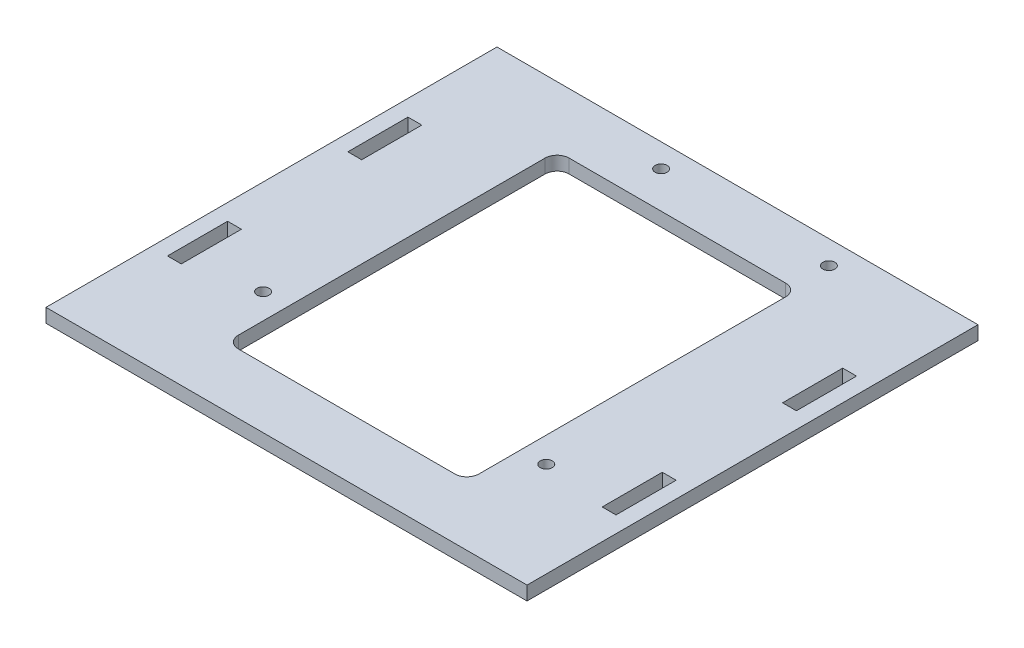
ISO-10303-21;
HEADER;
FILE_DESCRIPTION(('STEP AP214'),'2;1');
FILE_NAME('part.step','',(''),(''),'','','');
FILE_SCHEMA(('AUTOMOTIVE_DESIGN { 1 0 10303 214 1 1 1 1 }'));
ENDSEC;
DATA;
#1=APPLICATION_CONTEXT('core data for automotive mechanical design processes');
#2=APPLICATION_PROTOCOL_DEFINITION('international standard','automotive_design',2000,#1);
#3=PRODUCT_CONTEXT('',#1,'mechanical');
#4=PRODUCT('Part','Part','',(#3));
#5=PRODUCT_RELATED_PRODUCT_CATEGORY('part','',(#4));
#6=PRODUCT_DEFINITION_FORMATION('','',#4);
#7=PRODUCT_DEFINITION_CONTEXT('part definition',#1,'design');
#8=PRODUCT_DEFINITION('design','',#6,#7);
#9=PRODUCT_DEFINITION_SHAPE('','',#8);
#10=(LENGTH_UNIT() NAMED_UNIT(*) SI_UNIT(.MILLI.,.METRE.));
#11=(NAMED_UNIT(*) PLANE_ANGLE_UNIT() SI_UNIT($,.RADIAN.));
#12=(NAMED_UNIT(*) SI_UNIT($,.STERADIAN.) SOLID_ANGLE_UNIT());
#13=UNCERTAINTY_MEASURE_WITH_UNIT(LENGTH_MEASURE(1.E-05),#10,'distance_accuracy_value','');
#14=(GEOMETRIC_REPRESENTATION_CONTEXT(3) GLOBAL_UNCERTAINTY_ASSIGNED_CONTEXT((#13)) GLOBAL_UNIT_ASSIGNED_CONTEXT((#10,
#11,#12)) REPRESENTATION_CONTEXT('',''));
#15=CARTESIAN_POINT('',(0.,0.,0.));
#16=DIRECTION('',(0.,0.,1.));
#17=DIRECTION('',(1.,0.,0.));
#18=AXIS2_PLACEMENT_3D('',#15,#16,#17);
#19=CARTESIAN_POINT('',(0.,2.3,0.));
#20=DIRECTION('',(1.,0.,0.));
#21=DIRECTION('',(0.,0.,-1.));
#22=AXIS2_PLACEMENT_3D('',#19,#20,#21);
#23=PLANE('',#22);
#24=DIRECTION('',(0.,0.,1.));
#25=VECTOR('',#24,1.);
#26=CARTESIAN_POINT('',(0.,0.,0.));
#27=LINE('',#26,#25);
#28=CARTESIAN_POINT('',(0.,0.,-75.));
#29=VERTEX_POINT('',#28);
#30=CARTESIAN_POINT('',(0.,0.,0.));
#31=VERTEX_POINT('',#30);
#32=EDGE_CURVE('E359',#29,#31,#27,.T.);
#33=ORIENTED_EDGE('',*,*,#32,.T.);
#34=DIRECTION('',(0.,-1.,0.));
#35=VECTOR('',#34,1.);
#36=CARTESIAN_POINT('',(0.,2.3,0.));
#37=LINE('',#36,#35);
#38=CARTESIAN_POINT('',(0.,2.3,0.));
#39=VERTEX_POINT('',#38);
#40=EDGE_CURVE('E386',#39,#31,#37,.T.);
#41=ORIENTED_EDGE('',*,*,#40,.F.);
#42=DIRECTION('',(0.,0.,1.));
#43=VECTOR('',#42,1.);
#44=CARTESIAN_POINT('',(0.,2.3,0.));
#45=LINE('',#44,#43);
#46=CARTESIAN_POINT('',(0.,2.3,-75.));
#47=VERTEX_POINT('',#46);
#48=EDGE_CURVE('E360',#47,#39,#45,.T.);
#49=ORIENTED_EDGE('',*,*,#48,.F.);
#50=DIRECTION('',(0.,-1.,0.));
#51=VECTOR('',#50,1.);
#52=CARTESIAN_POINT('',(0.,2.3,-75.));
#53=LINE('',#52,#51);
#54=EDGE_CURVE('E370',#47,#29,#53,.T.);
#55=ORIENTED_EDGE('',*,*,#54,.T.);
#56=EDGE_LOOP('',(#33,#41,#49,#55));
#57=FACE_BOUND('',#56,.T.);
#58=ADVANCED_FACE('F33',(#57),#23,.F.);
#59=CARTESIAN_POINT('',(0.,2.3,0.));
#60=DIRECTION('',(0.,0.,-1.));
#61=DIRECTION('',(-1.,0.,0.));
#62=AXIS2_PLACEMENT_3D('',#59,#60,#61);
#63=PLANE('',#62);
#64=DIRECTION('',(1.,0.,0.));
#65=VECTOR('',#64,1.);
#66=CARTESIAN_POINT('',(0.,0.,0.));
#67=LINE('',#66,#65);
#68=CARTESIAN_POINT('',(80.,0.,0.));
#69=VERTEX_POINT('',#68);
#70=EDGE_CURVE('E373',#31,#69,#67,.T.);
#71=ORIENTED_EDGE('',*,*,#70,.T.);
#72=DIRECTION('',(0.,-1.,0.));
#73=VECTOR('',#72,1.);
#74=CARTESIAN_POINT('',(80.,2.3,0.));
#75=LINE('',#74,#73);
#76=CARTESIAN_POINT('',(80.,2.3,0.));
#77=VERTEX_POINT('',#76);
#78=EDGE_CURVE('E383',#77,#69,#75,.T.);
#79=ORIENTED_EDGE('',*,*,#78,.F.);
#80=DIRECTION('',(1.,0.,0.));
#81=VECTOR('',#80,1.);
#82=CARTESIAN_POINT('',(0.,2.3,0.));
#83=LINE('',#82,#81);
#84=EDGE_CURVE('E363',#39,#77,#83,.T.);
#85=ORIENTED_EDGE('',*,*,#84,.F.);
#86=ORIENTED_EDGE('',*,*,#40,.T.);
#87=EDGE_LOOP('',(#71,#79,#85,#86));
#88=FACE_BOUND('',#87,.T.);
#89=ADVANCED_FACE('F465',(#88),#63,.F.);
#90=CARTESIAN_POINT('',(80.,2.3,-75.));
#91=DIRECTION('',(-1.,0.,0.));
#92=DIRECTION('',(0.,0.,1.));
#93=AXIS2_PLACEMENT_3D('',#90,#91,#92);
#94=PLANE('',#93);
#95=DIRECTION('',(0.,0.,-1.));
#96=VECTOR('',#95,1.);
#97=CARTESIAN_POINT('',(80.,0.,-75.));
#98=LINE('',#97,#96);
#99=CARTESIAN_POINT('',(80.,0.,-75.));
#100=VERTEX_POINT('',#99);
#101=EDGE_CURVE('E375',#69,#100,#98,.T.);
#102=ORIENTED_EDGE('',*,*,#101,.T.);
#103=DIRECTION('',(0.,-1.,0.));
#104=VECTOR('',#103,1.);
#105=CARTESIAN_POINT('',(80.,2.3,-75.));
#106=LINE('',#105,#104);
#107=CARTESIAN_POINT('',(80.,2.3,-75.));
#108=VERTEX_POINT('',#107);
#109=EDGE_CURVE('E380',#108,#100,#106,.T.);
#110=ORIENTED_EDGE('',*,*,#109,.F.);
#111=DIRECTION('',(0.,0.,-1.));
#112=VECTOR('',#111,1.);
#113=CARTESIAN_POINT('',(80.,2.3,-75.));
#114=LINE('',#113,#112);
#115=EDGE_CURVE('E366',#77,#108,#114,.T.);
#116=ORIENTED_EDGE('',*,*,#115,.F.);
#117=ORIENTED_EDGE('',*,*,#78,.T.);
#118=EDGE_LOOP('',(#102,#110,#116,#117));
#119=FACE_BOUND('',#118,.T.);
#120=ADVANCED_FACE('F471',(#119),#94,.F.);
#121=CARTESIAN_POINT('',(0.,2.3,-75.));
#122=DIRECTION('',(0.,0.,1.));
#123=DIRECTION('',(1.,0.,0.));
#124=AXIS2_PLACEMENT_3D('',#121,#122,#123);
#125=PLANE('',#124);
#126=DIRECTION('',(-1.,0.,0.));
#127=VECTOR('',#126,1.);
#128=CARTESIAN_POINT('',(0.,0.,-75.));
#129=LINE('',#128,#127);
#130=EDGE_CURVE('E364',#100,#29,#129,.T.);
#131=ORIENTED_EDGE('',*,*,#130,.T.);
#132=ORIENTED_EDGE('',*,*,#54,.F.);
#133=DIRECTION('',(-1.,0.,0.));
#134=VECTOR('',#133,1.);
#135=CARTESIAN_POINT('',(0.,2.3,-75.));
#136=LINE('',#135,#134);
#137=EDGE_CURVE('E368',#108,#47,#136,.T.);
#138=ORIENTED_EDGE('',*,*,#137,.F.);
#139=ORIENTED_EDGE('',*,*,#109,.T.);
#140=EDGE_LOOP('',(#131,#132,#138,#139));
#141=FACE_BOUND('',#140,.T.);
#142=ADVANCED_FACE('F518',(#141),#125,.F.);
#143=CARTESIAN_POINT('',(0.,2.3,0.));
#144=DIRECTION('',(0.,-1.,0.));
#145=DIRECTION('',(0.,0.,-1.));
#146=AXIS2_PLACEMENT_3D('',#143,#144,#145);
#147=PLANE('',#146);
#148=DIRECTION('',(0.,0.,-1.));
#149=VECTOR('',#148,1.);
#150=CARTESIAN_POINT('',(60.,2.3,-10.));
#151=LINE('',#150,#149);
#152=CARTESIAN_POINT('',(60.,2.3,-12.));
#153=VERTEX_POINT('',#152);
#154=CARTESIAN_POINT('',(60.,2.3,-63.));
#155=VERTEX_POINT('',#154);
#156=EDGE_CURVE('E489',#153,#155,#151,.T.);
#157=ORIENTED_EDGE('',*,*,#156,.F.);
#158=CARTESIAN_POINT('',(58.,2.3,-12.));
#159=DIRECTION('',(0.,-1.,0.));
#160=DIRECTION('',(0.,0.,-1.));
#161=AXIS2_PLACEMENT_3D('',#158,#159,#160);
#162=CIRCLE('',#161,2.);
#163=CARTESIAN_POINT('',(58.,2.3,-10.));
#164=VERTEX_POINT('',#163);
#165=EDGE_CURVE('E433',#153,#164,#162,.T.);
#166=ORIENTED_EDGE('',*,*,#165,.T.);
#167=DIRECTION('',(1.,0.,0.));
#168=VECTOR('',#167,1.);
#169=CARTESIAN_POINT('',(40.,2.3,-10.));
#170=LINE('',#169,#168);
#171=CARTESIAN_POINT('',(22.,2.3,-10.));
#172=VERTEX_POINT('',#171);
#173=EDGE_CURVE('E497',#172,#164,#170,.T.);
#174=ORIENTED_EDGE('',*,*,#173,.F.);
#175=CARTESIAN_POINT('',(22.,2.3,-12.));
#176=DIRECTION('',(0.,-1.,0.));
#177=DIRECTION('',(0.,0.,-1.));
#178=AXIS2_PLACEMENT_3D('',#175,#176,#177);
#179=CIRCLE('',#178,2.);
#180=CARTESIAN_POINT('',(20.,2.3,-12.));
#181=VERTEX_POINT('',#180);
#182=EDGE_CURVE('E437',#172,#181,#179,.T.);
#183=ORIENTED_EDGE('',*,*,#182,.T.);
#184=DIRECTION('',(0.,0.,1.));
#185=VECTOR('',#184,1.);
#186=CARTESIAN_POINT('',(20.,2.3,-65.));
#187=LINE('',#186,#185);
#188=CARTESIAN_POINT('',(20.,2.3,-63.));
#189=VERTEX_POINT('',#188);
#190=EDGE_CURVE('E492',#189,#181,#187,.T.);
#191=ORIENTED_EDGE('',*,*,#190,.F.);
#192=CARTESIAN_POINT('',(22.,2.3,-63.));
#193=DIRECTION('',(0.,-1.,0.));
#194=DIRECTION('',(0.,0.,-1.));
#195=AXIS2_PLACEMENT_3D('',#192,#193,#194);
#196=CIRCLE('',#195,2.);
#197=CARTESIAN_POINT('',(22.,2.3,-65.));
#198=VERTEX_POINT('',#197);
#199=EDGE_CURVE('E41',#189,#198,#196,.T.);
#200=ORIENTED_EDGE('',*,*,#199,.T.);
#201=DIRECTION('',(-1.,0.,0.));
#202=VECTOR('',#201,1.);
#203=CARTESIAN_POINT('',(60.,2.3,-65.));
#204=LINE('',#203,#202);
#205=CARTESIAN_POINT('',(58.,2.3,-65.));
#206=VERTEX_POINT('',#205);
#207=EDGE_CURVE('E490',#206,#198,#204,.T.);
#208=ORIENTED_EDGE('',*,*,#207,.F.);
#209=CARTESIAN_POINT('',(58.,2.3,-63.));
#210=DIRECTION('',(0.,-1.,0.));
#211=DIRECTION('',(0.,0.,-1.));
#212=AXIS2_PLACEMENT_3D('',#209,#210,#211);
#213=CIRCLE('',#212,2.);
#214=EDGE_CURVE('E55',#206,#155,#213,.T.);
#215=ORIENTED_EDGE('',*,*,#214,.T.);
#216=EDGE_LOOP('',(#157,#166,#174,#183,#191,#200,#208,#215));
#217=FACE_BOUND('',#216,.T.);
#218=CARTESIAN_POINT('',(59.1,2.3,-71.1));
#219=DIRECTION('',(0.,1.,0.));
#220=DIRECTION('',(0.,0.,1.));
#221=AXIS2_PLACEMENT_3D('',#218,#219,#220);
#222=CIRCLE('',#221,0.999999999999998);
#223=CARTESIAN_POINT('',(59.1,2.3,-70.1));
#224=VERTEX_POINT('',#223);
#225=EDGE_CURVE('E397',#224,#224,#222,.T.);
#226=ORIENTED_EDGE('',*,*,#225,.F.);
#227=EDGE_LOOP('',(#226));
#228=FACE_BOUND('',#227,.T.);
#229=CARTESIAN_POINT('',(15.8,2.3,-20.3));
#230=DIRECTION('',(0.,1.,0.));
#231=DIRECTION('',(0.,0.,1.));
#232=AXIS2_PLACEMENT_3D('',#229,#230,#231);
#233=CIRCLE('',#232,1.);
#234=CARTESIAN_POINT('',(15.8,2.3,-19.3));
#235=VERTEX_POINT('',#234);
#236=EDGE_CURVE('E503',#235,#235,#233,.T.);
#237=ORIENTED_EDGE('',*,*,#236,.F.);
#238=EDGE_LOOP('',(#237));
#239=FACE_BOUND('',#238,.T.);
#240=CARTESIAN_POINT('',(64.2,2.3,-19.));
#241=DIRECTION('',(0.,1.,0.));
#242=DIRECTION('',(0.,0.,1.));
#243=AXIS2_PLACEMENT_3D('',#240,#241,#242);
#244=CIRCLE('',#243,0.999999999999998);
#245=CARTESIAN_POINT('',(64.2,2.3,-18.));
#246=VERTEX_POINT('',#245);
#247=EDGE_CURVE('E500',#246,#246,#244,.T.);
#248=ORIENTED_EDGE('',*,*,#247,.F.);
#249=EDGE_LOOP('',(#248));
#250=FACE_BOUND('',#249,.T.);
#251=CARTESIAN_POINT('',(31.2,2.3,-71.1));
#252=DIRECTION('',(0.,1.,0.));
#253=DIRECTION('',(0.,0.,1.));
#254=AXIS2_PLACEMENT_3D('',#251,#252,#253);
#255=CIRCLE('',#254,0.999999999999995);
#256=CARTESIAN_POINT('',(31.2,2.3,-70.1));
#257=VERTEX_POINT('',#256);
#258=EDGE_CURVE('E392',#257,#257,#255,.T.);
#259=ORIENTED_EDGE('',*,*,#258,.F.);
#260=EDGE_LOOP('',(#259));
#261=FACE_BOUND('',#260,.T.);
#262=DIRECTION('',(0.,0.,-1.));
#263=VECTOR('',#262,1.);
#264=CARTESIAN_POINT('',(2.69999999999999,2.3,0.));
#265=LINE('',#264,#263);
#266=CARTESIAN_POINT('',(2.69999999999999,2.3,-17.5));
#267=VERTEX_POINT('',#266);
#268=CARTESIAN_POINT('',(2.69999999999999,2.3,-27.5));
#269=VERTEX_POINT('',#268);
#270=EDGE_CURVE('E321',#267,#269,#265,.T.);
#271=ORIENTED_EDGE('',*,*,#270,.T.);
#272=DIRECTION('',(1.,0.,0.));
#273=VECTOR('',#272,1.);
#274=CARTESIAN_POINT('',(0.,2.3,-27.5));
#275=LINE('',#274,#273);
#276=CARTESIAN_POINT('',(4.99999999999999,2.3,-27.5));
#277=VERTEX_POINT('',#276);
#278=EDGE_CURVE('E324',#269,#277,#275,.T.);
#279=ORIENTED_EDGE('',*,*,#278,.T.);
#280=DIRECTION('',(0.,0.,1.));
#281=VECTOR('',#280,1.);
#282=CARTESIAN_POINT('',(4.99999999999999,2.3,0.));
#283=LINE('',#282,#281);
#284=CARTESIAN_POINT('',(4.99999999999999,2.3,-17.5));
#285=VERTEX_POINT('',#284);
#286=EDGE_CURVE('E315',#277,#285,#283,.T.);
#287=ORIENTED_EDGE('',*,*,#286,.T.);
#288=DIRECTION('',(-1.,0.,0.));
#289=VECTOR('',#288,1.);
#290=CARTESIAN_POINT('',(0.,2.3,-17.5));
#291=LINE('',#290,#289);
#292=EDGE_CURVE('E318',#285,#267,#291,.T.);
#293=ORIENTED_EDGE('',*,*,#292,.T.);
#294=EDGE_LOOP('',(#271,#279,#287,#293));
#295=FACE_BOUND('',#294,.T.);
#296=DIRECTION('',(0.,0.,-1.));
#297=VECTOR('',#296,1.);
#298=CARTESIAN_POINT('',(75.,2.3,0.));
#299=LINE('',#298,#297);
#300=CARTESIAN_POINT('',(75.,2.3,-47.5));
#301=VERTEX_POINT('',#300);
#302=CARTESIAN_POINT('',(75.,2.3,-57.5));
#303=VERTEX_POINT('',#302);
#304=EDGE_CURVE('E309',#301,#303,#299,.T.);
#305=ORIENTED_EDGE('',*,*,#304,.T.);
#306=DIRECTION('',(1.,0.,0.));
#307=VECTOR('',#306,1.);
#308=CARTESIAN_POINT('',(0.,2.3,-57.5));
#309=LINE('',#308,#307);
#310=CARTESIAN_POINT('',(77.3,2.3,-57.5));
#311=VERTEX_POINT('',#310);
#312=EDGE_CURVE('E312',#303,#311,#309,.T.);
#313=ORIENTED_EDGE('',*,*,#312,.T.);
#314=DIRECTION('',(0.,0.,1.));
#315=VECTOR('',#314,1.);
#316=CARTESIAN_POINT('',(77.3000000000001,2.3,-1.07275299754406E-13));
#317=LINE('',#316,#315);
#318=CARTESIAN_POINT('',(77.3,2.3,-47.5));
#319=VERTEX_POINT('',#318);
#320=EDGE_CURVE('E306',#311,#319,#317,.T.);
#321=ORIENTED_EDGE('',*,*,#320,.T.);
#322=DIRECTION('',(-1.,0.,0.));
#323=VECTOR('',#322,1.);
#324=CARTESIAN_POINT('',(0.,2.3,-47.5));
#325=LINE('',#324,#323);
#326=EDGE_CURVE('E226',#319,#301,#325,.T.);
#327=ORIENTED_EDGE('',*,*,#326,.T.);
#328=EDGE_LOOP('',(#305,#313,#321,#327));
#329=FACE_BOUND('',#328,.T.);
#330=DIRECTION('',(0.,0.,-1.));
#331=VECTOR('',#330,1.);
#332=CARTESIAN_POINT('',(2.69999999999999,2.3,0.));
#333=LINE('',#332,#331);
#334=CARTESIAN_POINT('',(2.69999999999999,2.3,-47.5));
#335=VERTEX_POINT('',#334);
#336=CARTESIAN_POINT('',(2.69999999999999,2.3,-57.5));
#337=VERTEX_POINT('',#336);
#338=EDGE_CURVE('E300',#335,#337,#333,.T.);
#339=ORIENTED_EDGE('',*,*,#338,.T.);
#340=DIRECTION('',(1.,0.,0.));
#341=VECTOR('',#340,1.);
#342=CARTESIAN_POINT('',(0.,2.3,-57.5));
#343=LINE('',#342,#341);
#344=CARTESIAN_POINT('',(4.99999999999999,2.3,-57.5));
#345=VERTEX_POINT('',#344);
#346=EDGE_CURVE('E303',#337,#345,#343,.T.);
#347=ORIENTED_EDGE('',*,*,#346,.T.);
#348=DIRECTION('',(0.,0.,1.));
#349=VECTOR('',#348,1.);
#350=CARTESIAN_POINT('',(4.99999999999999,2.3,0.));
#351=LINE('',#350,#349);
#352=CARTESIAN_POINT('',(4.99999999999999,2.3,-47.5));
#353=VERTEX_POINT('',#352);
#354=EDGE_CURVE('E288',#345,#353,#351,.T.);
#355=ORIENTED_EDGE('',*,*,#354,.T.);
#356=DIRECTION('',(-1.,0.,0.));
#357=VECTOR('',#356,1.);
#358=CARTESIAN_POINT('',(0.,2.3,-47.5));
#359=LINE('',#358,#357);
#360=EDGE_CURVE('E297',#353,#335,#359,.T.);
#361=ORIENTED_EDGE('',*,*,#360,.T.);
#362=EDGE_LOOP('',(#339,#347,#355,#361));
#363=FACE_BOUND('',#362,.T.);
#364=DIRECTION('',(0.,0.,-1.));
#365=VECTOR('',#364,1.);
#366=CARTESIAN_POINT('',(75.,2.3,0.));
#367=LINE('',#366,#365);
#368=CARTESIAN_POINT('',(75.,2.3,-17.5));
#369=VERTEX_POINT('',#368);
#370=CARTESIAN_POINT('',(75.,2.3,-27.5));
#371=VERTEX_POINT('',#370);
#372=EDGE_CURVE('E353',#369,#371,#367,.T.);
#373=ORIENTED_EDGE('',*,*,#372,.T.);
#374=DIRECTION('',(1.,0.,0.));
#375=VECTOR('',#374,1.);
#376=CARTESIAN_POINT('',(0.,2.3,-27.5000000000001));
#377=LINE('',#376,#375);
#378=CARTESIAN_POINT('',(77.3,2.3,-27.5));
#379=VERTEX_POINT('',#378);
#380=EDGE_CURVE('E356',#371,#379,#377,.T.);
#381=ORIENTED_EDGE('',*,*,#380,.T.);
#382=DIRECTION('',(0.,0.,1.));
#383=VECTOR('',#382,1.);
#384=CARTESIAN_POINT('',(77.3,2.3,0.));
#385=LINE('',#384,#383);
#386=CARTESIAN_POINT('',(77.3,2.3,-17.5));
#387=VERTEX_POINT('',#386);
#388=EDGE_CURVE('E341',#379,#387,#385,.T.);
#389=ORIENTED_EDGE('',*,*,#388,.T.);
#390=DIRECTION('',(-1.,0.,0.));
#391=VECTOR('',#390,1.);
#392=CARTESIAN_POINT('',(0.,2.3,-17.5));
#393=LINE('',#392,#391);
#394=EDGE_CURVE('E350',#387,#369,#393,.T.);
#395=ORIENTED_EDGE('',*,*,#394,.T.);
#396=EDGE_LOOP('',(#373,#381,#389,#395));
#397=FACE_BOUND('',#396,.T.);
#398=ORIENTED_EDGE('',*,*,#48,.T.);
#399=ORIENTED_EDGE('',*,*,#84,.T.);
#400=ORIENTED_EDGE('',*,*,#115,.T.);
#401=ORIENTED_EDGE('',*,*,#137,.T.);
#402=EDGE_LOOP('',(#398,#399,#400,#401));
#403=FACE_BOUND('',#402,.T.);
#404=ADVANCED_FACE('F515',(#217,#228,#239,#250,#261,#295,#329,#363,#397,#403),#147,.F.);
#405=CARTESIAN_POINT('',(0.,0.,0.));
#406=DIRECTION('',(0.,-1.,0.));
#407=DIRECTION('',(0.,0.,-1.));
#408=AXIS2_PLACEMENT_3D('',#405,#406,#407);
#409=PLANE('',#408);
#410=DIRECTION('',(-1.,0.,0.));
#411=VECTOR('',#410,1.);
#412=CARTESIAN_POINT('',(0.,0.,-9.99999999999999));
#413=LINE('',#412,#411);
#414=CARTESIAN_POINT('',(58.,0.,-10.));
#415=VERTEX_POINT('',#414);
#416=CARTESIAN_POINT('',(22.,0.,-10.));
#417=VERTEX_POINT('',#416);
#418=EDGE_CURVE('E411',#415,#417,#413,.T.);
#419=ORIENTED_EDGE('',*,*,#418,.F.);
#420=CARTESIAN_POINT('',(58.,0.,-12.));
#421=DIRECTION('',(0.,-1.,0.));
#422=DIRECTION('',(0.,0.,-1.));
#423=AXIS2_PLACEMENT_3D('',#420,#421,#422);
#424=CIRCLE('',#423,2.);
#425=CARTESIAN_POINT('',(60.,0.,-12.));
#426=VERTEX_POINT('',#425);
#427=EDGE_CURVE('E435',#415,#426,#424,.F.);
#428=ORIENTED_EDGE('',*,*,#427,.T.);
#429=DIRECTION('',(0.,0.,1.));
#430=VECTOR('',#429,1.);
#431=CARTESIAN_POINT('',(60.,0.,0.));
#432=LINE('',#431,#430);
#433=CARTESIAN_POINT('',(60.,0.,-63.));
#434=VERTEX_POINT('',#433);
#435=EDGE_CURVE('E389',#434,#426,#432,.T.);
#436=ORIENTED_EDGE('',*,*,#435,.F.);
#437=CARTESIAN_POINT('',(58.,0.,-63.));
#438=DIRECTION('',(0.,-1.,0.));
#439=DIRECTION('',(0.,0.,-1.));
#440=AXIS2_PLACEMENT_3D('',#437,#438,#439);
#441=CIRCLE('',#440,2.);
#442=CARTESIAN_POINT('',(58.,0.,-65.));
#443=VERTEX_POINT('',#442);
#444=EDGE_CURVE('E442',#434,#443,#441,.F.);
#445=ORIENTED_EDGE('',*,*,#444,.T.);
#446=DIRECTION('',(1.,0.,0.));
#447=VECTOR('',#446,1.);
#448=CARTESIAN_POINT('',(0.,0.,-65.));
#449=LINE('',#448,#447);
#450=CARTESIAN_POINT('',(22.,0.,-65.));
#451=VERTEX_POINT('',#450);
#452=EDGE_CURVE('E405',#451,#443,#449,.T.);
#453=ORIENTED_EDGE('',*,*,#452,.F.);
#454=CARTESIAN_POINT('',(22.,0.,-63.));
#455=DIRECTION('',(0.,-1.,0.));
#456=DIRECTION('',(0.,0.,-1.));
#457=AXIS2_PLACEMENT_3D('',#454,#455,#456);
#458=CIRCLE('',#457,2.);
#459=CARTESIAN_POINT('',(20.,0.,-63.));
#460=VERTEX_POINT('',#459);
#461=EDGE_CURVE('E11',#451,#460,#458,.F.);
#462=ORIENTED_EDGE('',*,*,#461,.T.);
#463=DIRECTION('',(0.,0.,-1.));
#464=VECTOR('',#463,1.);
#465=CARTESIAN_POINT('',(20.,0.,0.));
#466=LINE('',#465,#464);
#467=CARTESIAN_POINT('',(20.,0.,-12.));
#468=VERTEX_POINT('',#467);
#469=EDGE_CURVE('E408',#468,#460,#466,.T.);
#470=ORIENTED_EDGE('',*,*,#469,.F.);
#471=CARTESIAN_POINT('',(22.,0.,-12.));
#472=DIRECTION('',(0.,-1.,0.));
#473=DIRECTION('',(0.,0.,-1.));
#474=AXIS2_PLACEMENT_3D('',#471,#472,#473);
#475=CIRCLE('',#474,2.);
#476=EDGE_CURVE('E439',#468,#417,#475,.F.);
#477=ORIENTED_EDGE('',*,*,#476,.T.);
#478=EDGE_LOOP('',(#419,#428,#436,#445,#453,#462,#470,#477));
#479=FACE_BOUND('',#478,.T.);
#480=CARTESIAN_POINT('',(59.1,0.,-71.1));
#481=DIRECTION('',(0.,-1.,0.));
#482=DIRECTION('',(0.,0.,-1.));
#483=AXIS2_PLACEMENT_3D('',#480,#481,#482);
#484=CIRCLE('',#483,0.999999999999998);
#485=CARTESIAN_POINT('',(59.1,0.,-72.1));
#486=VERTEX_POINT('',#485);
#487=EDGE_CURVE('E400',#486,#486,#484,.T.);
#488=ORIENTED_EDGE('',*,*,#487,.F.);
#489=EDGE_LOOP('',(#488));
#490=FACE_BOUND('',#489,.T.);
#491=CARTESIAN_POINT('',(15.8,0.,-20.3));
#492=DIRECTION('',(0.,-1.,0.));
#493=DIRECTION('',(0.,0.,-1.));
#494=AXIS2_PLACEMENT_3D('',#491,#492,#493);
#495=CIRCLE('',#494,1.);
#496=CARTESIAN_POINT('',(15.8,0.,-21.3));
#497=VERTEX_POINT('',#496);
#498=EDGE_CURVE('E396',#497,#497,#495,.T.);
#499=ORIENTED_EDGE('',*,*,#498,.F.);
#500=EDGE_LOOP('',(#499));
#501=FACE_BOUND('',#500,.T.);
#502=CARTESIAN_POINT('',(64.2,0.,-19.));
#503=DIRECTION('',(0.,-1.,0.));
#504=DIRECTION('',(0.,0.,-1.));
#505=AXIS2_PLACEMENT_3D('',#502,#503,#504);
#506=CIRCLE('',#505,0.999999999999998);
#507=CARTESIAN_POINT('',(64.2,0.,-20.));
#508=VERTEX_POINT('',#507);
#509=EDGE_CURVE('E393',#508,#508,#506,.T.);
#510=ORIENTED_EDGE('',*,*,#509,.F.);
#511=EDGE_LOOP('',(#510));
#512=FACE_BOUND('',#511,.T.);
#513=CARTESIAN_POINT('',(31.2,0.,-71.1));
#514=DIRECTION('',(0.,-1.,0.));
#515=DIRECTION('',(0.,0.,-1.));
#516=AXIS2_PLACEMENT_3D('',#513,#514,#515);
#517=CIRCLE('',#516,0.999999999999995);
#518=CARTESIAN_POINT('',(31.2,0.,-72.1));
#519=VERTEX_POINT('',#518);
#520=EDGE_CURVE('E257',#519,#519,#517,.T.);
#521=ORIENTED_EDGE('',*,*,#520,.F.);
#522=EDGE_LOOP('',(#521));
#523=FACE_BOUND('',#522,.T.);
#524=DIRECTION('',(1.,0.,0.));
#525=VECTOR('',#524,1.);
#526=CARTESIAN_POINT('',(4.99999999999999,0.,-27.5));
#527=LINE('',#526,#525);
#528=CARTESIAN_POINT('',(2.69999999999999,0.,-27.5));
#529=VERTEX_POINT('',#528);
#530=CARTESIAN_POINT('',(4.99999999999999,0.,-27.5));
#531=VERTEX_POINT('',#530);
#532=EDGE_CURVE('E254',#529,#531,#527,.T.);
#533=ORIENTED_EDGE('',*,*,#532,.F.);
#534=DIRECTION('',(0.,0.,-1.));
#535=VECTOR('',#534,1.);
#536=CARTESIAN_POINT('',(2.69999999999999,0.,-27.5));
#537=LINE('',#536,#535);
#538=CARTESIAN_POINT('',(2.69999999999999,0.,-17.5));
#539=VERTEX_POINT('',#538);
#540=EDGE_CURVE('E263',#539,#529,#537,.T.);
#541=ORIENTED_EDGE('',*,*,#540,.F.);
#542=DIRECTION('',(-1.,0.,0.));
#543=VECTOR('',#542,1.);
#544=CARTESIAN_POINT('',(2.69999999999999,0.,-17.5));
#545=LINE('',#544,#543);
#546=CARTESIAN_POINT('',(4.99999999999999,0.,-17.5));
#547=VERTEX_POINT('',#546);
#548=EDGE_CURVE('E260',#547,#539,#545,.T.);
#549=ORIENTED_EDGE('',*,*,#548,.F.);
#550=DIRECTION('',(0.,0.,1.));
#551=VECTOR('',#550,1.);
#552=CARTESIAN_POINT('',(4.99999999999999,0.,-17.5));
#553=LINE('',#552,#551);
#554=EDGE_CURVE('E256',#531,#547,#553,.T.);
#555=ORIENTED_EDGE('',*,*,#554,.F.);
#556=EDGE_LOOP('',(#533,#541,#549,#555));
#557=FACE_BOUND('',#556,.T.);
#558=DIRECTION('',(1.,0.,0.));
#559=VECTOR('',#558,1.);
#560=CARTESIAN_POINT('',(77.3,0.,-57.5));
#561=LINE('',#560,#559);
#562=CARTESIAN_POINT('',(75.,0.,-57.5));
#563=VERTEX_POINT('',#562);
#564=CARTESIAN_POINT('',(77.3,0.,-57.5));
#565=VERTEX_POINT('',#564);
#566=EDGE_CURVE('E239',#563,#565,#561,.T.);
#567=ORIENTED_EDGE('',*,*,#566,.F.);
#568=DIRECTION('',(0.,0.,-1.));
#569=VECTOR('',#568,1.);
#570=CARTESIAN_POINT('',(75.,0.,-57.5));
#571=LINE('',#570,#569);
#572=CARTESIAN_POINT('',(75.,0.,-47.5));
#573=VERTEX_POINT('',#572);
#574=EDGE_CURVE('E244',#573,#563,#571,.T.);
#575=ORIENTED_EDGE('',*,*,#574,.F.);
#576=DIRECTION('',(-1.,0.,0.));
#577=VECTOR('',#576,1.);
#578=CARTESIAN_POINT('',(75.,0.,-47.5));
#579=LINE('',#578,#577);
#580=CARTESIAN_POINT('',(77.3,0.,-47.5));
#581=VERTEX_POINT('',#580);
#582=EDGE_CURVE('E223',#581,#573,#579,.T.);
#583=ORIENTED_EDGE('',*,*,#582,.F.);
#584=DIRECTION('',(0.,0.,1.));
#585=VECTOR('',#584,1.);
#586=CARTESIAN_POINT('',(77.3,0.,-57.5));
#587=LINE('',#586,#585);
#588=EDGE_CURVE('E234',#565,#581,#587,.T.);
#589=ORIENTED_EDGE('',*,*,#588,.F.);
#590=EDGE_LOOP('',(#567,#575,#583,#589));
#591=FACE_BOUND('',#590,.T.);
#592=DIRECTION('',(1.,0.,0.));
#593=VECTOR('',#592,1.);
#594=CARTESIAN_POINT('',(4.99999999999999,0.,-57.5));
#595=LINE('',#594,#593);
#596=CARTESIAN_POINT('',(2.69999999999999,0.,-57.5));
#597=VERTEX_POINT('',#596);
#598=CARTESIAN_POINT('',(4.99999999999999,0.,-57.5));
#599=VERTEX_POINT('',#598);
#600=EDGE_CURVE('E251',#597,#599,#595,.T.);
#601=ORIENTED_EDGE('',*,*,#600,.F.);
#602=DIRECTION('',(0.,0.,-1.));
#603=VECTOR('',#602,1.);
#604=CARTESIAN_POINT('',(2.69999999999999,0.,-57.5));
#605=LINE('',#604,#603);
#606=CARTESIAN_POINT('',(2.69999999999999,0.,-47.5));
#607=VERTEX_POINT('',#606);
#608=EDGE_CURVE('E282',#607,#597,#605,.T.);
#609=ORIENTED_EDGE('',*,*,#608,.F.);
#610=DIRECTION('',(-1.,0.,0.));
#611=VECTOR('',#610,1.);
#612=CARTESIAN_POINT('',(2.69999999999999,0.,-47.5));
#613=LINE('',#612,#611);
#614=CARTESIAN_POINT('',(4.99999999999999,0.,-47.5));
#615=VERTEX_POINT('',#614);
#616=EDGE_CURVE('E279',#615,#607,#613,.T.);
#617=ORIENTED_EDGE('',*,*,#616,.F.);
#618=DIRECTION('',(0.,0.,1.));
#619=VECTOR('',#618,1.);
#620=CARTESIAN_POINT('',(4.99999999999999,0.,-47.5));
#621=LINE('',#620,#619);
#622=EDGE_CURVE('E276',#599,#615,#621,.T.);
#623=ORIENTED_EDGE('',*,*,#622,.F.);
#624=EDGE_LOOP('',(#601,#609,#617,#623));
#625=FACE_BOUND('',#624,.T.);
#626=DIRECTION('',(1.,0.,0.));
#627=VECTOR('',#626,1.);
#628=CARTESIAN_POINT('',(75.,0.,-27.5));
#629=LINE('',#628,#627);
#630=CARTESIAN_POINT('',(75.,0.,-27.5));
#631=VERTEX_POINT('',#630);
#632=CARTESIAN_POINT('',(77.3,0.,-27.5));
#633=VERTEX_POINT('',#632);
#634=EDGE_CURVE('E327',#631,#633,#629,.T.);
#635=ORIENTED_EDGE('',*,*,#634,.F.);
#636=DIRECTION('',(0.,0.,-1.));
#637=VECTOR('',#636,1.);
#638=CARTESIAN_POINT('',(75.,0.,-17.5));
#639=LINE('',#638,#637);
#640=CARTESIAN_POINT('',(75.,0.,-17.5));
#641=VERTEX_POINT('',#640);
#642=EDGE_CURVE('E335',#641,#631,#639,.T.);
#643=ORIENTED_EDGE('',*,*,#642,.F.);
#644=DIRECTION('',(-1.,0.,0.));
#645=VECTOR('',#644,1.);
#646=CARTESIAN_POINT('',(77.3,0.,-17.5));
#647=LINE('',#646,#645);
#648=CARTESIAN_POINT('',(77.3,0.,-17.5));
#649=VERTEX_POINT('',#648);
#650=EDGE_CURVE('E332',#649,#641,#647,.T.);
#651=ORIENTED_EDGE('',*,*,#650,.F.);
#652=DIRECTION('',(0.,0.,1.));
#653=VECTOR('',#652,1.);
#654=CARTESIAN_POINT('',(77.3,0.,-27.5));
#655=LINE('',#654,#653);
#656=EDGE_CURVE('E329',#633,#649,#655,.T.);
#657=ORIENTED_EDGE('',*,*,#656,.F.);
#658=EDGE_LOOP('',(#635,#643,#651,#657));
#659=FACE_BOUND('',#658,.T.);
#660=ORIENTED_EDGE('',*,*,#32,.F.);
#661=ORIENTED_EDGE('',*,*,#130,.F.);
#662=ORIENTED_EDGE('',*,*,#101,.F.);
#663=ORIENTED_EDGE('',*,*,#70,.F.);
#664=EDGE_LOOP('',(#660,#661,#662,#663));
#665=FACE_BOUND('',#664,.T.);
#666=ADVANCED_FACE('F241',(#479,#490,#501,#512,#523,#557,#591,#625,#659,#665),#409,.T.);
#667=CARTESIAN_POINT('',(75.,10.,-27.5));
#668=DIRECTION('',(0.,0.,-1.));
#669=DIRECTION('',(-1.,0.,0.));
#670=AXIS2_PLACEMENT_3D('',#667,#668,#669);
#671=PLANE('',#670);
#672=DIRECTION('',(0.,-1.,0.));
#673=VECTOR('',#672,1.);
#674=CARTESIAN_POINT('',(75.,10.,-27.5));
#675=LINE('',#674,#673);
#676=EDGE_CURVE('E339',#371,#631,#675,.T.);
#677=ORIENTED_EDGE('',*,*,#676,.T.);
#678=ORIENTED_EDGE('',*,*,#634,.T.);
#679=DIRECTION('',(0.,-1.,0.));
#680=VECTOR('',#679,1.);
#681=CARTESIAN_POINT('',(77.3,10.,-27.5));
#682=LINE('',#681,#680);
#683=EDGE_CURVE('E338',#379,#633,#682,.T.);
#684=ORIENTED_EDGE('',*,*,#683,.F.);
#685=ORIENTED_EDGE('',*,*,#380,.F.);
#686=EDGE_LOOP('',(#677,#678,#684,#685));
#687=FACE_BOUND('',#686,.T.);
#688=ADVANCED_FACE('F536',(#687),#671,.F.);
#689=CARTESIAN_POINT('',(75.,10.,-17.5));
#690=DIRECTION('',(-1.,0.,0.));
#691=DIRECTION('',(0.,0.,1.));
#692=AXIS2_PLACEMENT_3D('',#689,#690,#691);
#693=PLANE('',#692);
#694=DIRECTION('',(0.,-1.,0.));
#695=VECTOR('',#694,1.);
#696=CARTESIAN_POINT('',(75.,10.,-17.5));
#697=LINE('',#696,#695);
#698=EDGE_CURVE('E342',#369,#641,#697,.T.);
#699=ORIENTED_EDGE('',*,*,#698,.T.);
#700=ORIENTED_EDGE('',*,*,#642,.T.);
#701=ORIENTED_EDGE('',*,*,#676,.F.);
#702=ORIENTED_EDGE('',*,*,#372,.F.);
#703=EDGE_LOOP('',(#699,#700,#701,#702));
#704=FACE_BOUND('',#703,.T.);
#705=ADVANCED_FACE('F541',(#704),#693,.F.);
#706=CARTESIAN_POINT('',(77.3,10.,-17.5));
#707=DIRECTION('',(0.,0.,1.));
#708=DIRECTION('',(1.,0.,0.));
#709=AXIS2_PLACEMENT_3D('',#706,#707,#708);
#710=PLANE('',#709);
#711=DIRECTION('',(0.,-1.,0.));
#712=VECTOR('',#711,1.);
#713=CARTESIAN_POINT('',(77.3,10.,-17.5));
#714=LINE('',#713,#712);
#715=EDGE_CURVE('E344',#387,#649,#714,.T.);
#716=ORIENTED_EDGE('',*,*,#715,.T.);
#717=ORIENTED_EDGE('',*,*,#650,.T.);
#718=ORIENTED_EDGE('',*,*,#698,.F.);
#719=ORIENTED_EDGE('',*,*,#394,.F.);
#720=EDGE_LOOP('',(#716,#717,#718,#719));
#721=FACE_BOUND('',#720,.T.);
#722=ADVANCED_FACE('F688',(#721),#710,.F.);
#723=CARTESIAN_POINT('',(77.3,10.,-27.5));
#724=DIRECTION('',(1.,0.,0.));
#725=DIRECTION('',(0.,0.,-1.));
#726=AXIS2_PLACEMENT_3D('',#723,#724,#725);
#727=PLANE('',#726);
#728=ORIENTED_EDGE('',*,*,#683,.T.);
#729=ORIENTED_EDGE('',*,*,#656,.T.);
#730=ORIENTED_EDGE('',*,*,#715,.F.);
#731=ORIENTED_EDGE('',*,*,#388,.F.);
#732=EDGE_LOOP('',(#728,#729,#730,#731));
#733=FACE_BOUND('',#732,.T.);
#734=ADVANCED_FACE('F684',(#733),#727,.F.);
#735=CARTESIAN_POINT('',(4.99999999999999,10.,-57.5));
#736=DIRECTION('',(0.,0.,-1.));
#737=DIRECTION('',(-1.,0.,0.));
#738=AXIS2_PLACEMENT_3D('',#735,#736,#737);
#739=PLANE('',#738);
#740=DIRECTION('',(0.,-1.,0.));
#741=VECTOR('',#740,1.);
#742=CARTESIAN_POINT('',(2.69999999999999,10.,-57.5));
#743=LINE('',#742,#741);
#744=EDGE_CURVE('E286',#337,#597,#743,.T.);
#745=ORIENTED_EDGE('',*,*,#744,.T.);
#746=ORIENTED_EDGE('',*,*,#600,.T.);
#747=DIRECTION('',(0.,-1.,0.));
#748=VECTOR('',#747,1.);
#749=CARTESIAN_POINT('',(4.99999999999999,10.,-57.5));
#750=LINE('',#749,#748);
#751=EDGE_CURVE('E285',#345,#599,#750,.T.);
#752=ORIENTED_EDGE('',*,*,#751,.F.);
#753=ORIENTED_EDGE('',*,*,#346,.F.);
#754=EDGE_LOOP('',(#745,#746,#752,#753));
#755=FACE_BOUND('',#754,.T.);
#756=ADVANCED_FACE('F674',(#755),#739,.F.);
#757=CARTESIAN_POINT('',(2.69999999999999,10.,-57.5));
#758=DIRECTION('',(-1.,0.,0.));
#759=DIRECTION('',(0.,0.,1.));
#760=AXIS2_PLACEMENT_3D('',#757,#758,#759);
#761=PLANE('',#760);
#762=DIRECTION('',(0.,-1.,0.));
#763=VECTOR('',#762,1.);
#764=CARTESIAN_POINT('',(2.69999999999999,10.,-47.5));
#765=LINE('',#764,#763);
#766=EDGE_CURVE('E289',#335,#607,#765,.T.);
#767=ORIENTED_EDGE('',*,*,#766,.T.);
#768=ORIENTED_EDGE('',*,*,#608,.T.);
#769=ORIENTED_EDGE('',*,*,#744,.F.);
#770=ORIENTED_EDGE('',*,*,#338,.F.);
#771=EDGE_LOOP('',(#767,#768,#769,#770));
#772=FACE_BOUND('',#771,.T.);
#773=ADVANCED_FACE('F670',(#772),#761,.F.);
#774=CARTESIAN_POINT('',(2.69999999999999,10.,-47.5));
#775=DIRECTION('',(0.,0.,1.));
#776=DIRECTION('',(1.,0.,0.));
#777=AXIS2_PLACEMENT_3D('',#774,#775,#776);
#778=PLANE('',#777);
#779=DIRECTION('',(0.,-1.,0.));
#780=VECTOR('',#779,1.);
#781=CARTESIAN_POINT('',(4.99999999999999,10.,-47.5));
#782=LINE('',#781,#780);
#783=EDGE_CURVE('E291',#353,#615,#782,.T.);
#784=ORIENTED_EDGE('',*,*,#783,.T.);
#785=ORIENTED_EDGE('',*,*,#616,.T.);
#786=ORIENTED_EDGE('',*,*,#766,.F.);
#787=ORIENTED_EDGE('',*,*,#360,.F.);
#788=EDGE_LOOP('',(#784,#785,#786,#787));
#789=FACE_BOUND('',#788,.T.);
#790=ADVANCED_FACE('F673',(#789),#778,.F.);
#791=CARTESIAN_POINT('',(4.99999999999999,10.,-47.5));
#792=DIRECTION('',(1.,0.,0.));
#793=DIRECTION('',(0.,0.,-1.));
#794=AXIS2_PLACEMENT_3D('',#791,#792,#793);
#795=PLANE('',#794);
#796=ORIENTED_EDGE('',*,*,#751,.T.);
#797=ORIENTED_EDGE('',*,*,#622,.T.);
#798=ORIENTED_EDGE('',*,*,#783,.F.);
#799=ORIENTED_EDGE('',*,*,#354,.F.);
#800=EDGE_LOOP('',(#796,#797,#798,#799));
#801=FACE_BOUND('',#800,.T.);
#802=ADVANCED_FACE('F655',(#801),#795,.F.);
#803=CARTESIAN_POINT('',(77.3,10.,-57.5));
#804=DIRECTION('',(0.,0.,-1.));
#805=DIRECTION('',(-1.,0.,0.));
#806=AXIS2_PLACEMENT_3D('',#803,#804,#805);
#807=PLANE('',#806);
#808=DIRECTION('',(0.,-1.,0.));
#809=VECTOR('',#808,1.);
#810=CARTESIAN_POINT('',(75.,10.,-57.5));
#811=LINE('',#810,#809);
#812=EDGE_CURVE('E249',#303,#563,#811,.T.);
#813=ORIENTED_EDGE('',*,*,#812,.T.);
#814=ORIENTED_EDGE('',*,*,#566,.T.);
#815=DIRECTION('',(0.,-1.,0.));
#816=VECTOR('',#815,1.);
#817=CARTESIAN_POINT('',(77.3,10.,-57.5));
#818=LINE('',#817,#816);
#819=EDGE_CURVE('E230',#311,#565,#818,.T.);
#820=ORIENTED_EDGE('',*,*,#819,.F.);
#821=ORIENTED_EDGE('',*,*,#312,.F.);
#822=EDGE_LOOP('',(#813,#814,#820,#821));
#823=FACE_BOUND('',#822,.T.);
#824=ADVANCED_FACE('F510',(#823),#807,.F.);
#825=CARTESIAN_POINT('',(75.,10.,-57.5));
#826=DIRECTION('',(-1.,0.,0.));
#827=DIRECTION('',(0.,0.,1.));
#828=AXIS2_PLACEMENT_3D('',#825,#826,#827);
#829=PLANE('',#828);
#830=DIRECTION('',(0.,-1.,0.));
#831=VECTOR('',#830,1.);
#832=CARTESIAN_POINT('',(75.,10.,-47.5));
#833=LINE('',#832,#831);
#834=EDGE_CURVE('E229',#301,#573,#833,.T.);
#835=ORIENTED_EDGE('',*,*,#834,.T.);
#836=ORIENTED_EDGE('',*,*,#574,.T.);
#837=ORIENTED_EDGE('',*,*,#812,.F.);
#838=ORIENTED_EDGE('',*,*,#304,.F.);
#839=EDGE_LOOP('',(#835,#836,#837,#838));
#840=FACE_BOUND('',#839,.T.);
#841=ADVANCED_FACE('F513',(#840),#829,.F.);
#842=CARTESIAN_POINT('',(75.,10.,-47.5));
#843=DIRECTION('',(0.,0.,1.));
#844=DIRECTION('',(1.,0.,0.));
#845=AXIS2_PLACEMENT_3D('',#842,#843,#844);
#846=PLANE('',#845);
#847=DIRECTION('',(0.,-1.,0.));
#848=VECTOR('',#847,1.);
#849=CARTESIAN_POINT('',(77.3,10.,-47.5));
#850=LINE('',#849,#848);
#851=EDGE_CURVE('E218',#319,#581,#850,.T.);
#852=ORIENTED_EDGE('',*,*,#851,.T.);
#853=ORIENTED_EDGE('',*,*,#582,.T.);
#854=ORIENTED_EDGE('',*,*,#834,.F.);
#855=ORIENTED_EDGE('',*,*,#326,.F.);
#856=EDGE_LOOP('',(#852,#853,#854,#855));
#857=FACE_BOUND('',#856,.T.);
#858=ADVANCED_FACE('F220',(#857),#846,.F.);
#859=CARTESIAN_POINT('',(77.3,10.,-57.5));
#860=DIRECTION('',(1.,0.,0.));
#861=DIRECTION('',(0.,0.,-1.));
#862=AXIS2_PLACEMENT_3D('',#859,#860,#861);
#863=PLANE('',#862);
#864=ORIENTED_EDGE('',*,*,#819,.T.);
#865=ORIENTED_EDGE('',*,*,#588,.T.);
#866=ORIENTED_EDGE('',*,*,#851,.F.);
#867=ORIENTED_EDGE('',*,*,#320,.F.);
#868=EDGE_LOOP('',(#864,#865,#866,#867));
#869=FACE_BOUND('',#868,.T.);
#870=ADVANCED_FACE('F235',(#869),#863,.F.);
#871=CARTESIAN_POINT('',(4.99999999999999,10.,-27.5));
#872=DIRECTION('',(0.,0.,-1.));
#873=DIRECTION('',(-1.,0.,0.));
#874=AXIS2_PLACEMENT_3D('',#871,#872,#873);
#875=PLANE('',#874);
#876=DIRECTION('',(0.,-1.,0.));
#877=VECTOR('',#876,1.);
#878=CARTESIAN_POINT('',(2.69999999999999,10.,-27.5));
#879=LINE('',#878,#877);
#880=EDGE_CURVE('E267',#269,#529,#879,.T.);
#881=ORIENTED_EDGE('',*,*,#880,.T.);
#882=ORIENTED_EDGE('',*,*,#532,.T.);
#883=DIRECTION('',(0.,-1.,0.));
#884=VECTOR('',#883,1.);
#885=CARTESIAN_POINT('',(4.99999999999999,10.,-27.5));
#886=LINE('',#885,#884);
#887=EDGE_CURVE('E266',#277,#531,#886,.T.);
#888=ORIENTED_EDGE('',*,*,#887,.F.);
#889=ORIENTED_EDGE('',*,*,#278,.F.);
#890=EDGE_LOOP('',(#881,#882,#888,#889));
#891=FACE_BOUND('',#890,.T.);
#892=ADVANCED_FACE('F652',(#891),#875,.F.);
#893=CARTESIAN_POINT('',(2.69999999999999,10.,-27.5));
#894=DIRECTION('',(-1.,0.,0.));
#895=DIRECTION('',(0.,0.,1.));
#896=AXIS2_PLACEMENT_3D('',#893,#894,#895);
#897=PLANE('',#896);
#898=DIRECTION('',(0.,-1.,0.));
#899=VECTOR('',#898,1.);
#900=CARTESIAN_POINT('',(2.69999999999999,10.,-17.5));
#901=LINE('',#900,#899);
#902=EDGE_CURVE('E269',#267,#539,#901,.T.);
#903=ORIENTED_EDGE('',*,*,#902,.T.);
#904=ORIENTED_EDGE('',*,*,#540,.T.);
#905=ORIENTED_EDGE('',*,*,#880,.F.);
#906=ORIENTED_EDGE('',*,*,#270,.F.);
#907=EDGE_LOOP('',(#903,#904,#905,#906));
#908=FACE_BOUND('',#907,.T.);
#909=ADVANCED_FACE('F656',(#908),#897,.F.);
#910=CARTESIAN_POINT('',(2.69999999999999,10.,-17.5));
#911=DIRECTION('',(0.,0.,1.));
#912=DIRECTION('',(1.,0.,0.));
#913=AXIS2_PLACEMENT_3D('',#910,#911,#912);
#914=PLANE('',#913);
#915=DIRECTION('',(0.,-1.,0.));
#916=VECTOR('',#915,1.);
#917=CARTESIAN_POINT('',(4.99999999999999,10.,-17.5));
#918=LINE('',#917,#916);
#919=EDGE_CURVE('E271',#285,#547,#918,.T.);
#920=ORIENTED_EDGE('',*,*,#919,.T.);
#921=ORIENTED_EDGE('',*,*,#548,.T.);
#922=ORIENTED_EDGE('',*,*,#902,.F.);
#923=ORIENTED_EDGE('',*,*,#292,.F.);
#924=EDGE_LOOP('',(#920,#921,#922,#923));
#925=FACE_BOUND('',#924,.T.);
#926=ADVANCED_FACE('F659',(#925),#914,.F.);
#927=CARTESIAN_POINT('',(4.99999999999999,10.,-17.5));
#928=DIRECTION('',(1.,0.,0.));
#929=DIRECTION('',(0.,0.,-1.));
#930=AXIS2_PLACEMENT_3D('',#927,#928,#929);
#931=PLANE('',#930);
#932=ORIENTED_EDGE('',*,*,#887,.T.);
#933=ORIENTED_EDGE('',*,*,#554,.T.);
#934=ORIENTED_EDGE('',*,*,#919,.F.);
#935=ORIENTED_EDGE('',*,*,#286,.F.);
#936=EDGE_LOOP('',(#932,#933,#934,#935));
#937=FACE_BOUND('',#936,.T.);
#938=ADVANCED_FACE('F644',(#937),#931,.F.);
#939=CARTESIAN_POINT('',(31.2,-7.7,-71.1));
#940=DIRECTION('',(0.,1.,0.));
#941=DIRECTION('',(0.,0.,1.));
#942=AXIS2_PLACEMENT_3D('',#939,#940,#941);
#943=CYLINDRICAL_SURFACE('',#942,0.999999999999995);
#944=ORIENTED_EDGE('',*,*,#520,.T.);
#945=EDGE_LOOP('',(#944));
#946=FACE_BOUND('',#945,.T.);
#947=ORIENTED_EDGE('',*,*,#258,.T.);
#948=EDGE_LOOP('',(#947));
#949=FACE_BOUND('',#948,.T.);
#950=ADVANCED_FACE('F640',(#946,#949),#943,.F.);
#951=CARTESIAN_POINT('',(64.2,-7.7,-19.));
#952=DIRECTION('',(0.,1.,0.));
#953=DIRECTION('',(0.,0.,1.));
#954=AXIS2_PLACEMENT_3D('',#951,#952,#953);
#955=CYLINDRICAL_SURFACE('',#954,0.999999999999998);
#956=ORIENTED_EDGE('',*,*,#509,.T.);
#957=EDGE_LOOP('',(#956));
#958=FACE_BOUND('',#957,.T.);
#959=ORIENTED_EDGE('',*,*,#247,.T.);
#960=EDGE_LOOP('',(#959));
#961=FACE_BOUND('',#960,.T.);
#962=ADVANCED_FACE('F636',(#958,#961),#955,.F.);
#963=CARTESIAN_POINT('',(15.8,-7.7,-20.3));
#964=DIRECTION('',(0.,1.,0.));
#965=DIRECTION('',(0.,0.,1.));
#966=AXIS2_PLACEMENT_3D('',#963,#964,#965);
#967=CYLINDRICAL_SURFACE('',#966,1.);
#968=ORIENTED_EDGE('',*,*,#498,.T.);
#969=EDGE_LOOP('',(#968));
#970=FACE_BOUND('',#969,.T.);
#971=ORIENTED_EDGE('',*,*,#236,.T.);
#972=EDGE_LOOP('',(#971));
#973=FACE_BOUND('',#972,.T.);
#974=ADVANCED_FACE('F632',(#970,#973),#967,.F.);
#975=CARTESIAN_POINT('',(59.1,-7.7,-71.1));
#976=DIRECTION('',(0.,1.,0.));
#977=DIRECTION('',(0.,0.,1.));
#978=AXIS2_PLACEMENT_3D('',#975,#976,#977);
#979=CYLINDRICAL_SURFACE('',#978,0.999999999999998);
#980=ORIENTED_EDGE('',*,*,#487,.T.);
#981=EDGE_LOOP('',(#980));
#982=FACE_BOUND('',#981,.T.);
#983=ORIENTED_EDGE('',*,*,#225,.T.);
#984=EDGE_LOOP('',(#983));
#985=FACE_BOUND('',#984,.T.);
#986=ADVANCED_FACE('F566',(#982,#985),#979,.F.);
#987=CARTESIAN_POINT('',(40.,-7.7,-10.));
#988=DIRECTION('',(0.,0.,1.));
#989=DIRECTION('',(1.,0.,0.));
#990=AXIS2_PLACEMENT_3D('',#987,#988,#989);
#991=PLANE('',#990);
#992=ORIENTED_EDGE('',*,*,#173,.T.);
#993=DIRECTION('',(0.,1.,0.));
#994=VECTOR('',#993,1.);
#995=CARTESIAN_POINT('',(58.,0.,-10.));
#996=LINE('',#995,#994);
#997=EDGE_CURVE('E422',#164,#415,#996,.F.);
#998=ORIENTED_EDGE('',*,*,#997,.T.);
#999=ORIENTED_EDGE('',*,*,#418,.T.);
#1000=DIRECTION('',(0.,1.,0.));
#1001=VECTOR('',#1000,1.);
#1002=CARTESIAN_POINT('',(22.,2.3,-10.));
#1003=LINE('',#1002,#1001);
#1004=EDGE_CURVE('E419',#417,#172,#1003,.T.);
#1005=ORIENTED_EDGE('',*,*,#1004,.T.);
#1006=EDGE_LOOP('',(#992,#998,#999,#1005));
#1007=FACE_BOUND('',#1006,.T.);
#1008=ADVANCED_FACE('F576',(#1007),#991,.F.);
#1009=CARTESIAN_POINT('',(20.,-7.7,-65.));
#1010=DIRECTION('',(-1.,0.,0.));
#1011=DIRECTION('',(0.,0.,1.));
#1012=AXIS2_PLACEMENT_3D('',#1009,#1010,#1011);
#1013=PLANE('',#1012);
#1014=ORIENTED_EDGE('',*,*,#190,.T.);
#1015=DIRECTION('',(0.,1.,0.));
#1016=VECTOR('',#1015,1.);
#1017=CARTESIAN_POINT('',(20.,0.,-12.));
#1018=LINE('',#1017,#1016);
#1019=EDGE_CURVE('E427',#181,#468,#1018,.F.);
#1020=ORIENTED_EDGE('',*,*,#1019,.T.);
#1021=ORIENTED_EDGE('',*,*,#469,.T.);
#1022=DIRECTION('',(0.,1.,0.));
#1023=VECTOR('',#1022,1.);
#1024=CARTESIAN_POINT('',(20.,2.3,-63.));
#1025=LINE('',#1024,#1023);
#1026=EDGE_CURVE('E424',#460,#189,#1025,.T.);
#1027=ORIENTED_EDGE('',*,*,#1026,.T.);
#1028=EDGE_LOOP('',(#1014,#1020,#1021,#1027));
#1029=FACE_BOUND('',#1028,.T.);
#1030=ADVANCED_FACE('F581',(#1029),#1013,.F.);
#1031=CARTESIAN_POINT('',(60.,-7.7,-65.));
#1032=DIRECTION('',(0.,0.,-1.));
#1033=DIRECTION('',(-1.,0.,0.));
#1034=AXIS2_PLACEMENT_3D('',#1031,#1032,#1033);
#1035=PLANE('',#1034);
#1036=ORIENTED_EDGE('',*,*,#452,.T.);
#1037=DIRECTION('',(0.,1.,0.));
#1038=VECTOR('',#1037,1.);
#1039=CARTESIAN_POINT('',(58.,2.3,-65.));
#1040=LINE('',#1039,#1038);
#1041=EDGE_CURVE('E431',#443,#206,#1040,.T.);
#1042=ORIENTED_EDGE('',*,*,#1041,.T.);
#1043=ORIENTED_EDGE('',*,*,#207,.T.);
#1044=DIRECTION('',(0.,1.,0.));
#1045=VECTOR('',#1044,1.);
#1046=CARTESIAN_POINT('',(22.,0.,-65.));
#1047=LINE('',#1046,#1045);
#1048=EDGE_CURVE('E429',#198,#451,#1047,.F.);
#1049=ORIENTED_EDGE('',*,*,#1048,.T.);
#1050=EDGE_LOOP('',(#1036,#1042,#1043,#1049));
#1051=FACE_BOUND('',#1050,.T.);
#1052=ADVANCED_FACE('F451',(#1051),#1035,.F.);
#1053=CARTESIAN_POINT('',(60.,-7.7,-10.));
#1054=DIRECTION('',(1.,0.,0.));
#1055=DIRECTION('',(0.,0.,-1.));
#1056=AXIS2_PLACEMENT_3D('',#1053,#1054,#1055);
#1057=PLANE('',#1056);
#1058=ORIENTED_EDGE('',*,*,#435,.T.);
#1059=DIRECTION('',(0.,1.,0.));
#1060=VECTOR('',#1059,1.);
#1061=CARTESIAN_POINT('',(60.,2.3,-12.));
#1062=LINE('',#1061,#1060);
#1063=EDGE_CURVE('E416',#426,#153,#1062,.T.);
#1064=ORIENTED_EDGE('',*,*,#1063,.T.);
#1065=ORIENTED_EDGE('',*,*,#156,.T.);
#1066=DIRECTION('',(0.,1.,0.));
#1067=VECTOR('',#1066,1.);
#1068=CARTESIAN_POINT('',(60.,0.,-63.));
#1069=LINE('',#1068,#1067);
#1070=EDGE_CURVE('E414',#155,#434,#1069,.F.);
#1071=ORIENTED_EDGE('',*,*,#1070,.T.);
#1072=EDGE_LOOP('',(#1058,#1064,#1065,#1071));
#1073=FACE_BOUND('',#1072,.T.);
#1074=ADVANCED_FACE('F477',(#1073),#1057,.F.);
#1075=CARTESIAN_POINT('',(58.,-7.7,-12.));
#1076=DIRECTION('',(0.,-1.,0.));
#1077=DIRECTION('',(0.,0.,-1.));
#1078=AXIS2_PLACEMENT_3D('',#1075,#1076,#1077);
#1079=CYLINDRICAL_SURFACE('',#1078,2.);
#1080=ORIENTED_EDGE('',*,*,#427,.F.);
#1081=ORIENTED_EDGE('',*,*,#997,.F.);
#1082=ORIENTED_EDGE('',*,*,#165,.F.);
#1083=ORIENTED_EDGE('',*,*,#1063,.F.);
#1084=EDGE_LOOP('',(#1080,#1081,#1082,#1083));
#1085=FACE_BOUND('',#1084,.T.);
#1086=ADVANCED_FACE('F461',(#1085),#1079,.F.);
#1087=CARTESIAN_POINT('',(22.,-7.7,-12.));
#1088=DIRECTION('',(0.,-1.,0.));
#1089=DIRECTION('',(0.,0.,-1.));
#1090=AXIS2_PLACEMENT_3D('',#1087,#1088,#1089);
#1091=CYLINDRICAL_SURFACE('',#1090,2.);
#1092=ORIENTED_EDGE('',*,*,#476,.F.);
#1093=ORIENTED_EDGE('',*,*,#1019,.F.);
#1094=ORIENTED_EDGE('',*,*,#182,.F.);
#1095=ORIENTED_EDGE('',*,*,#1004,.F.);
#1096=EDGE_LOOP('',(#1092,#1093,#1094,#1095));
#1097=FACE_BOUND('',#1096,.T.);
#1098=ADVANCED_FACE('F455',(#1097),#1091,.F.);
#1099=CARTESIAN_POINT('',(58.,-7.7,-63.));
#1100=DIRECTION('',(0.,-1.,0.));
#1101=DIRECTION('',(0.,0.,-1.));
#1102=AXIS2_PLACEMENT_3D('',#1099,#1100,#1101);
#1103=CYLINDRICAL_SURFACE('',#1102,2.);
#1104=ORIENTED_EDGE('',*,*,#444,.F.);
#1105=ORIENTED_EDGE('',*,*,#1070,.F.);
#1106=ORIENTED_EDGE('',*,*,#214,.F.);
#1107=ORIENTED_EDGE('',*,*,#1041,.F.);
#1108=EDGE_LOOP('',(#1104,#1105,#1106,#1107));
#1109=FACE_BOUND('',#1108,.T.);
#1110=ADVANCED_FACE('F453',(#1109),#1103,.F.);
#1111=CARTESIAN_POINT('',(22.,-7.7,-63.));
#1112=DIRECTION('',(0.,-1.,0.));
#1113=DIRECTION('',(0.,0.,-1.));
#1114=AXIS2_PLACEMENT_3D('',#1111,#1112,#1113);
#1115=CYLINDRICAL_SURFACE('',#1114,2.);
#1116=ORIENTED_EDGE('',*,*,#461,.F.);
#1117=ORIENTED_EDGE('',*,*,#1048,.F.);
#1118=ORIENTED_EDGE('',*,*,#199,.F.);
#1119=ORIENTED_EDGE('',*,*,#1026,.F.);
#1120=EDGE_LOOP('',(#1116,#1117,#1118,#1119));
#1121=FACE_BOUND('',#1120,.T.);
#1122=ADVANCED_FACE('F35',(#1121),#1115,.F.);
#1123=CLOSED_SHELL('',(#58,#89,#120,#142,#404,#666,#688,#705,#722,#734,#756,#773,#790,#802,#824,
#841,#858,#870,#892,#909,#926,#938,#950,#962,#974,#986,#1008,#1030,#1052,#1074,#1086,#1098,
#1110,#1122));
#1124=MANIFOLD_SOLID_BREP('B2',#1123);
#1125=ADVANCED_BREP_SHAPE_REPRESENTATION('',(#18,#1124),#14);
#1126=SHAPE_DEFINITION_REPRESENTATION(#9,#1125);
ENDSEC;
END-ISO-10303-21;
